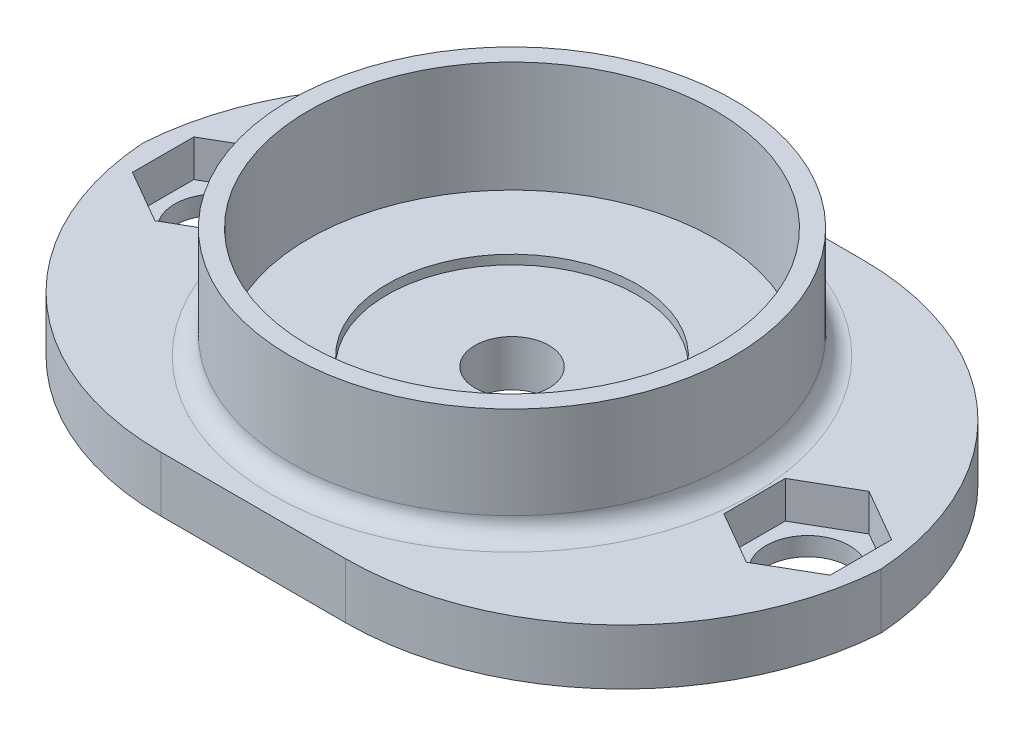
ISO-10303-21;
HEADER;
FILE_DESCRIPTION(('STEP AP214'),'2;1');
FILE_NAME('part.step','',(''),(''),'','','');
FILE_SCHEMA(('AUTOMOTIVE_DESIGN { 1 0 10303 214 1 1 1 1 }'));
ENDSEC;
DATA;
#1=APPLICATION_CONTEXT('core data for automotive mechanical design processes');
#2=APPLICATION_PROTOCOL_DEFINITION('international standard','automotive_design',2000,#1);
#3=PRODUCT_CONTEXT('',#1,'mechanical');
#4=PRODUCT('Part','Part','',(#3));
#5=PRODUCT_RELATED_PRODUCT_CATEGORY('part','',(#4));
#6=PRODUCT_DEFINITION_FORMATION('','',#4);
#7=PRODUCT_DEFINITION_CONTEXT('part definition',#1,'design');
#8=PRODUCT_DEFINITION('design','',#6,#7);
#9=PRODUCT_DEFINITION_SHAPE('','',#8);
#10=(LENGTH_UNIT() NAMED_UNIT(*) SI_UNIT(.MILLI.,.METRE.));
#11=(NAMED_UNIT(*) PLANE_ANGLE_UNIT() SI_UNIT($,.RADIAN.));
#12=(NAMED_UNIT(*) SI_UNIT($,.STERADIAN.) SOLID_ANGLE_UNIT());
#13=UNCERTAINTY_MEASURE_WITH_UNIT(LENGTH_MEASURE(1.E-05),#10,'distance_accuracy_value','');
#14=(GEOMETRIC_REPRESENTATION_CONTEXT(3) GLOBAL_UNCERTAINTY_ASSIGNED_CONTEXT((#13)) GLOBAL_UNIT_ASSIGNED_CONTEXT((#10,
#11,#12)) REPRESENTATION_CONTEXT('',''));
#15=CARTESIAN_POINT('',(0.,0.,0.));
#16=DIRECTION('',(0.,0.,1.));
#17=DIRECTION('',(1.,0.,0.));
#18=AXIS2_PLACEMENT_3D('',#15,#16,#17);
#19=CARTESIAN_POINT('',(0.,3.,0.));
#20=DIRECTION('',(0.,1.,0.));
#21=DIRECTION('',(0.,0.,1.));
#22=AXIS2_PLACEMENT_3D('',#19,#20,#21);
#23=PLANE('',#22);
#24=CARTESIAN_POINT('',(0.,3.,0.));
#25=DIRECTION('',(0.,1.,0.));
#26=DIRECTION('',(0.,0.,1.));
#27=AXIS2_PLACEMENT_3D('',#24,#25,#26);
#28=CIRCLE('',#27,13.);
#29=CARTESIAN_POINT('',(0.,3.,13.));
#30=VERTEX_POINT('',#29);
#31=EDGE_CURVE('E348',#30,#30,#28,.F.);
#32=ORIENTED_EDGE('',*,*,#31,.T.);
#33=EDGE_LOOP('',(#32));
#34=FACE_BOUND('',#33,.T.);
#35=DIRECTION('',(-0.866025403784439,0.,-0.5));
#36=VECTOR('',#35,1.);
#37=CARTESIAN_POINT('',(-13.125,3.,-1.65988202392017));
#38=LINE('',#37,#36);
#39=CARTESIAN_POINT('',(-13.125,3.,-1.65988202392017));
#40=VERTEX_POINT('',#39);
#41=CARTESIAN_POINT('',(-16.,3.,-3.31976404784035));
#42=VERTEX_POINT('',#41);
#43=EDGE_CURVE('E252',#40,#42,#38,.T.);
#44=ORIENTED_EDGE('',*,*,#43,.F.);
#45=DIRECTION('',(0.,0.,-1.));
#46=VECTOR('',#45,1.);
#47=CARTESIAN_POINT('',(-13.125,3.,1.65988202392017));
#48=LINE('',#47,#46);
#49=CARTESIAN_POINT('',(-13.125,3.,1.65988202392017));
#50=VERTEX_POINT('',#49);
#51=EDGE_CURVE('E258',#50,#40,#48,.T.);
#52=ORIENTED_EDGE('',*,*,#51,.F.);
#53=DIRECTION('',(0.866025403784439,0.,-0.5));
#54=VECTOR('',#53,1.);
#55=CARTESIAN_POINT('',(-16.,3.,3.31976404784035));
#56=LINE('',#55,#54);
#57=CARTESIAN_POINT('',(-16.,3.,3.31976404784035));
#58=VERTEX_POINT('',#57);
#59=EDGE_CURVE('E293',#58,#50,#56,.T.);
#60=ORIENTED_EDGE('',*,*,#59,.F.);
#61=DIRECTION('',(0.866025403784439,0.,0.5));
#62=VECTOR('',#61,1.);
#63=CARTESIAN_POINT('',(-18.875,3.,1.65988202392018));
#64=LINE('',#63,#62);
#65=CARTESIAN_POINT('',(-18.875,3.,1.65988202392018));
#66=VERTEX_POINT('',#65);
#67=EDGE_CURVE('E289',#66,#58,#64,.T.);
#68=ORIENTED_EDGE('',*,*,#67,.F.);
#69=DIRECTION('',(0.,0.,1.));
#70=VECTOR('',#69,1.);
#71=CARTESIAN_POINT('',(-18.875,3.,-1.65988202392017));
#72=LINE('',#71,#70);
#73=CARTESIAN_POINT('',(-18.875,3.,-1.65988202392017));
#74=VERTEX_POINT('',#73);
#75=EDGE_CURVE('E285',#74,#66,#72,.T.);
#76=ORIENTED_EDGE('',*,*,#75,.F.);
#77=DIRECTION('',(-0.866025403784439,0.,0.5));
#78=VECTOR('',#77,1.);
#79=CARTESIAN_POINT('',(-16.,3.,-3.31976404784035));
#80=LINE('',#79,#78);
#81=EDGE_CURVE('E281',#42,#74,#80,.T.);
#82=ORIENTED_EDGE('',*,*,#81,.F.);
#83=EDGE_LOOP('',(#44,#52,#60,#68,#76,#82));
#84=FACE_BOUND('',#83,.T.);
#85=DIRECTION('',(-1.,0.,0.));
#86=VECTOR('',#85,1.);
#87=CARTESIAN_POINT('',(-20.,3.,-14.));
#88=LINE('',#87,#86);
#89=CARTESIAN_POINT('',(5.,3.,-14.));
#90=VERTEX_POINT('',#89);
#91=CARTESIAN_POINT('',(-5.,3.,-14.));
#92=VERTEX_POINT('',#91);
#93=EDGE_CURVE('E330',#90,#92,#88,.T.);
#94=ORIENTED_EDGE('',*,*,#93,.T.);
#95=CARTESIAN_POINT('',(-5.,3.,0.999999999999999));
#96=DIRECTION('',(0.,1.,0.));
#97=DIRECTION('',(0.,0.,1.));
#98=AXIS2_PLACEMENT_3D('',#95,#96,#97);
#99=CIRCLE('',#98,15.);
#100=CARTESIAN_POINT('',(-19.9666295470958,3.,0.));
#101=VERTEX_POINT('',#100);
#102=EDGE_CURVE('E57',#92,#101,#99,.T.);
#103=ORIENTED_EDGE('',*,*,#102,.T.);
#104=CARTESIAN_POINT('',(-5.,3.,-0.999999999999999));
#105=DIRECTION('',(0.,1.,0.));
#106=DIRECTION('',(0.,0.,1.));
#107=AXIS2_PLACEMENT_3D('',#104,#105,#106);
#108=CIRCLE('',#107,15.);
#109=CARTESIAN_POINT('',(-5.,3.,14.));
#110=VERTEX_POINT('',#109);
#111=EDGE_CURVE('E376',#101,#110,#108,.T.);
#112=ORIENTED_EDGE('',*,*,#111,.T.);
#113=DIRECTION('',(1.,0.,0.));
#114=VECTOR('',#113,1.);
#115=CARTESIAN_POINT('',(-20.,3.,14.));
#116=LINE('',#115,#114);
#117=CARTESIAN_POINT('',(5.,3.,14.));
#118=VERTEX_POINT('',#117);
#119=EDGE_CURVE('E327',#110,#118,#116,.T.);
#120=ORIENTED_EDGE('',*,*,#119,.T.);
#121=CARTESIAN_POINT('',(5.,3.,-0.999999999999999));
#122=DIRECTION('',(0.,1.,0.));
#123=DIRECTION('',(0.,0.,1.));
#124=AXIS2_PLACEMENT_3D('',#121,#122,#123);
#125=CIRCLE('',#124,15.);
#126=CARTESIAN_POINT('',(19.9666295470958,3.,0.));
#127=VERTEX_POINT('',#126);
#128=EDGE_CURVE('E64',#118,#127,#125,.T.);
#129=ORIENTED_EDGE('',*,*,#128,.T.);
#130=CARTESIAN_POINT('',(5.,3.,0.999999999999999));
#131=DIRECTION('',(0.,1.,0.));
#132=DIRECTION('',(0.,0.,1.));
#133=AXIS2_PLACEMENT_3D('',#130,#131,#132);
#134=CIRCLE('',#133,15.);
#135=EDGE_CURVE('E371',#127,#90,#134,.T.);
#136=ORIENTED_EDGE('',*,*,#135,.T.);
#137=EDGE_LOOP('',(#94,#103,#112,#120,#129,#136));
#138=FACE_BOUND('',#137,.T.);
#139=DIRECTION('',(0.,0.,-1.));
#140=VECTOR('',#139,1.);
#141=CARTESIAN_POINT('',(13.125,3.,1.65988202392017));
#142=LINE('',#141,#140);
#143=CARTESIAN_POINT('',(13.125,3.,1.65988202392017));
#144=VERTEX_POINT('',#143);
#145=CARTESIAN_POINT('',(13.125,3.,-1.65988202392017));
#146=VERTEX_POINT('',#145);
#147=EDGE_CURVE('E216',#144,#146,#142,.T.);
#148=ORIENTED_EDGE('',*,*,#147,.T.);
#149=DIRECTION('',(0.866025403784439,0.,-0.5));
#150=VECTOR('',#149,1.);
#151=CARTESIAN_POINT('',(13.125,3.,-1.65988202392017));
#152=LINE('',#151,#150);
#153=CARTESIAN_POINT('',(16.,3.,-3.31976404784035));
#154=VERTEX_POINT('',#153);
#155=EDGE_CURVE('E187',#146,#154,#152,.T.);
#156=ORIENTED_EDGE('',*,*,#155,.T.);
#157=DIRECTION('',(0.866025403784439,0.,0.5));
#158=VECTOR('',#157,1.);
#159=CARTESIAN_POINT('',(16.,3.,-3.31976404784035));
#160=LINE('',#159,#158);
#161=CARTESIAN_POINT('',(18.875,3.,-1.65988202392017));
#162=VERTEX_POINT('',#161);
#163=EDGE_CURVE('E194',#154,#162,#160,.T.);
#164=ORIENTED_EDGE('',*,*,#163,.T.);
#165=DIRECTION('',(0.,0.,1.));
#166=VECTOR('',#165,1.);
#167=CARTESIAN_POINT('',(18.875,3.,-1.65988202392017));
#168=LINE('',#167,#166);
#169=CARTESIAN_POINT('',(18.875,3.,1.65988202392018));
#170=VERTEX_POINT('',#169);
#171=EDGE_CURVE('E198',#162,#170,#168,.T.);
#172=ORIENTED_EDGE('',*,*,#171,.T.);
#173=DIRECTION('',(-0.866025403784439,0.,0.5));
#174=VECTOR('',#173,1.);
#175=CARTESIAN_POINT('',(18.875,3.,1.65988202392018));
#176=LINE('',#175,#174);
#177=CARTESIAN_POINT('',(16.,3.,3.31976404784035));
#178=VERTEX_POINT('',#177);
#179=EDGE_CURVE('E223',#170,#178,#176,.T.);
#180=ORIENTED_EDGE('',*,*,#179,.T.);
#181=DIRECTION('',(-0.866025403784439,0.,-0.5));
#182=VECTOR('',#181,1.);
#183=CARTESIAN_POINT('',(16.,3.,3.31976404784035));
#184=LINE('',#183,#182);
#185=EDGE_CURVE('E219',#178,#144,#184,.T.);
#186=ORIENTED_EDGE('',*,*,#185,.T.);
#187=EDGE_LOOP('',(#148,#156,#164,#172,#180,#186));
#188=FACE_BOUND('',#187,.T.);
#189=ADVANCED_FACE('F39',(#34,#84,#138,#188),#23,.T.);
#190=CARTESIAN_POINT('',(-20.,3.,14.));
#191=DIRECTION('',(0.,0.,-1.));
#192=DIRECTION('',(-1.,0.,0.));
#193=AXIS2_PLACEMENT_3D('',#190,#191,#192);
#194=PLANE('',#193);
#195=DIRECTION('',(1.,0.,0.));
#196=VECTOR('',#195,1.);
#197=CARTESIAN_POINT('',(-20.,0.,14.));
#198=LINE('',#197,#196);
#199=CARTESIAN_POINT('',(-5.,0.,14.));
#200=VERTEX_POINT('',#199);
#201=CARTESIAN_POINT('',(5.,0.,14.));
#202=VERTEX_POINT('',#201);
#203=EDGE_CURVE('E326',#200,#202,#198,.T.);
#204=ORIENTED_EDGE('',*,*,#203,.T.);
#205=DIRECTION('',(0.,-1.,0.));
#206=VECTOR('',#205,1.);
#207=CARTESIAN_POINT('',(5.,3.,14.));
#208=LINE('',#207,#206);
#209=EDGE_CURVE('E11',#202,#118,#208,.F.);
#210=ORIENTED_EDGE('',*,*,#209,.T.);
#211=ORIENTED_EDGE('',*,*,#119,.F.);
#212=DIRECTION('',(0.,-1.,0.));
#213=VECTOR('',#212,1.);
#214=CARTESIAN_POINT('',(-5.,3.,14.));
#215=LINE('',#214,#213);
#216=EDGE_CURVE('E49',#110,#200,#215,.T.);
#217=ORIENTED_EDGE('',*,*,#216,.T.);
#218=EDGE_LOOP('',(#204,#210,#211,#217));
#219=FACE_BOUND('',#218,.T.);
#220=ADVANCED_FACE('F436',(#219),#194,.F.);
#221=CARTESIAN_POINT('',(-20.,3.,-14.));
#222=DIRECTION('',(0.,0.,1.));
#223=DIRECTION('',(1.,0.,0.));
#224=AXIS2_PLACEMENT_3D('',#221,#222,#223);
#225=PLANE('',#224);
#226=DIRECTION('',(-1.,0.,0.));
#227=VECTOR('',#226,1.);
#228=CARTESIAN_POINT('',(-20.,0.,-14.));
#229=LINE('',#228,#227);
#230=CARTESIAN_POINT('',(5.,0.,-14.));
#231=VERTEX_POINT('',#230);
#232=CARTESIAN_POINT('',(-5.,0.,-14.));
#233=VERTEX_POINT('',#232);
#234=EDGE_CURVE('E331',#231,#233,#229,.T.);
#235=ORIENTED_EDGE('',*,*,#234,.T.);
#236=DIRECTION('',(0.,-1.,0.));
#237=VECTOR('',#236,1.);
#238=CARTESIAN_POINT('',(-5.,3.,-14.));
#239=LINE('',#238,#237);
#240=EDGE_CURVE('E367',#233,#92,#239,.F.);
#241=ORIENTED_EDGE('',*,*,#240,.T.);
#242=ORIENTED_EDGE('',*,*,#93,.F.);
#243=DIRECTION('',(0.,-1.,0.));
#244=VECTOR('',#243,1.);
#245=CARTESIAN_POINT('',(5.,3.,-14.));
#246=LINE('',#245,#244);
#247=EDGE_CURVE('E364',#90,#231,#246,.T.);
#248=ORIENTED_EDGE('',*,*,#247,.T.);
#249=EDGE_LOOP('',(#235,#241,#242,#248));
#250=FACE_BOUND('',#249,.T.);
#251=ADVANCED_FACE('F443',(#250),#225,.F.);
#252=CARTESIAN_POINT('',(0.,0.,0.));
#253=DIRECTION('',(0.,1.,0.));
#254=DIRECTION('',(0.,0.,1.));
#255=AXIS2_PLACEMENT_3D('',#252,#253,#254);
#256=PLANE('',#255);
#257=CARTESIAN_POINT('',(0.,0.,0.));
#258=DIRECTION('',(0.,1.,0.));
#259=DIRECTION('',(0.,0.,1.));
#260=AXIS2_PLACEMENT_3D('',#257,#258,#259);
#261=CIRCLE('',#260,2.);
#262=CARTESIAN_POINT('',(0.,0.,2.));
#263=VERTEX_POINT('',#262);
#264=EDGE_CURVE('E405',#263,#263,#261,.T.);
#265=ORIENTED_EDGE('',*,*,#264,.T.);
#266=EDGE_LOOP('',(#265));
#267=FACE_BOUND('',#266,.T.);
#268=CARTESIAN_POINT('',(16.,0.,0.));
#269=DIRECTION('',(0.,1.,0.));
#270=DIRECTION('',(0.,0.,1.));
#271=AXIS2_PLACEMENT_3D('',#268,#269,#270);
#272=CIRCLE('',#271,2.25);
#273=CARTESIAN_POINT('',(16.,0.,2.25));
#274=VERTEX_POINT('',#273);
#275=EDGE_CURVE('E201',#274,#274,#272,.T.);
#276=ORIENTED_EDGE('',*,*,#275,.T.);
#277=EDGE_LOOP('',(#276));
#278=FACE_BOUND('',#277,.T.);
#279=CARTESIAN_POINT('',(-16.,0.,0.));
#280=DIRECTION('',(0.,1.,0.));
#281=DIRECTION('',(0.,0.,1.));
#282=AXIS2_PLACEMENT_3D('',#279,#280,#281);
#283=CIRCLE('',#282,2.25);
#284=CARTESIAN_POINT('',(-16.,0.,2.25));
#285=VERTEX_POINT('',#284);
#286=EDGE_CURVE('E248',#285,#285,#283,.T.);
#287=ORIENTED_EDGE('',*,*,#286,.T.);
#288=EDGE_LOOP('',(#287));
#289=FACE_BOUND('',#288,.T.);
#290=CARTESIAN_POINT('',(-5.,0.,-0.999999999999999));
#291=DIRECTION('',(0.,1.,0.));
#292=DIRECTION('',(0.,0.,1.));
#293=AXIS2_PLACEMENT_3D('',#290,#291,#292);
#294=CIRCLE('',#293,15.);
#295=CARTESIAN_POINT('',(-19.9666295470958,0.,0.));
#296=VERTEX_POINT('',#295);
#297=EDGE_CURVE('E358',#200,#296,#294,.F.);
#298=ORIENTED_EDGE('',*,*,#297,.T.);
#299=CARTESIAN_POINT('',(-5.,0.,0.999999999999999));
#300=DIRECTION('',(0.,1.,0.));
#301=DIRECTION('',(0.,0.,1.));
#302=AXIS2_PLACEMENT_3D('',#299,#300,#301);
#303=CIRCLE('',#302,15.);
#304=EDGE_CURVE('E361',#296,#233,#303,.F.);
#305=ORIENTED_EDGE('',*,*,#304,.T.);
#306=ORIENTED_EDGE('',*,*,#234,.F.);
#307=CARTESIAN_POINT('',(5.,0.,0.999999999999999));
#308=DIRECTION('',(0.,1.,0.));
#309=DIRECTION('',(0.,0.,1.));
#310=AXIS2_PLACEMENT_3D('',#307,#308,#309);
#311=CIRCLE('',#310,15.);
#312=CARTESIAN_POINT('',(19.9666295470958,0.,0.));
#313=VERTEX_POINT('',#312);
#314=EDGE_CURVE('E352',#231,#313,#311,.F.);
#315=ORIENTED_EDGE('',*,*,#314,.T.);
#316=CARTESIAN_POINT('',(5.,0.,-0.999999999999999));
#317=DIRECTION('',(0.,1.,0.));
#318=DIRECTION('',(0.,0.,1.));
#319=AXIS2_PLACEMENT_3D('',#316,#317,#318);
#320=CIRCLE('',#319,15.);
#321=EDGE_CURVE('E355',#313,#202,#320,.F.);
#322=ORIENTED_EDGE('',*,*,#321,.T.);
#323=ORIENTED_EDGE('',*,*,#203,.F.);
#324=EDGE_LOOP('',(#298,#305,#306,#315,#322,#323));
#325=FACE_BOUND('',#324,.T.);
#326=ADVANCED_FACE('F416',(#267,#278,#289,#325),#256,.F.);
#327=CARTESIAN_POINT('',(0.,9.,0.));
#328=DIRECTION('',(0.,1.,0.));
#329=DIRECTION('',(0.,0.,1.));
#330=AXIS2_PLACEMENT_3D('',#327,#328,#329);
#331=PLANE('',#330);
#332=CARTESIAN_POINT('',(0.,9.,0.));
#333=DIRECTION('',(0.,1.,0.));
#334=DIRECTION('',(0.,0.,1.));
#335=AXIS2_PLACEMENT_3D('',#332,#333,#334);
#336=CIRCLE('',#335,12.);
#337=CARTESIAN_POINT('',(0.,9.,12.));
#338=VERTEX_POINT('',#337);
#339=EDGE_CURVE('E322',#338,#338,#336,.T.);
#340=ORIENTED_EDGE('',*,*,#339,.T.);
#341=EDGE_LOOP('',(#340));
#342=FACE_BOUND('',#341,.T.);
#343=CARTESIAN_POINT('',(0.,9.,0.));
#344=DIRECTION('',(0.,1.,0.));
#345=DIRECTION('',(0.,0.,1.));
#346=AXIS2_PLACEMENT_3D('',#343,#344,#345);
#347=CIRCLE('',#346,11.);
#348=CARTESIAN_POINT('',(0.,9.,11.));
#349=VERTEX_POINT('',#348);
#350=EDGE_CURVE('E303',#349,#349,#347,.T.);
#351=ORIENTED_EDGE('',*,*,#350,.F.);
#352=EDGE_LOOP('',(#351));
#353=FACE_BOUND('',#352,.T.);
#354=ADVANCED_FACE('F471',(#342,#353),#331,.T.);
#355=CARTESIAN_POINT('',(0.,9.,0.));
#356=DIRECTION('',(0.,-1.,0.));
#357=DIRECTION('',(0.,0.,-1.));
#358=AXIS2_PLACEMENT_3D('',#355,#356,#357);
#359=CYLINDRICAL_SURFACE('',#358,12.);
#360=CARTESIAN_POINT('',(0.,4.,0.));
#361=DIRECTION('',(0.,1.,0.));
#362=DIRECTION('',(0.,0.,1.));
#363=AXIS2_PLACEMENT_3D('',#360,#361,#362);
#364=CIRCLE('',#363,12.);
#365=CARTESIAN_POINT('',(0.,4.,12.));
#366=VERTEX_POINT('',#365);
#367=EDGE_CURVE('E344',#366,#366,#364,.T.);
#368=ORIENTED_EDGE('',*,*,#367,.T.);
#369=EDGE_LOOP('',(#368));
#370=FACE_BOUND('',#369,.T.);
#371=ORIENTED_EDGE('',*,*,#339,.F.);
#372=EDGE_LOOP('',(#371));
#373=FACE_BOUND('',#372,.T.);
#374=ADVANCED_FACE('F460',(#370,#373),#359,.T.);
#375=CARTESIAN_POINT('',(0.,9.,0.));
#376=DIRECTION('',(0.,-1.,0.));
#377=DIRECTION('',(0.,0.,-1.));
#378=AXIS2_PLACEMENT_3D('',#375,#376,#377);
#379=CYLINDRICAL_SURFACE('',#378,11.);
#380=ORIENTED_EDGE('',*,*,#350,.T.);
#381=EDGE_LOOP('',(#380));
#382=FACE_BOUND('',#381,.T.);
#383=CARTESIAN_POINT('',(0.,3.,0.));
#384=DIRECTION('',(0.,1.,0.));
#385=DIRECTION('',(0.,0.,1.));
#386=AXIS2_PLACEMENT_3D('',#383,#384,#385);
#387=CIRCLE('',#386,11.);
#388=CARTESIAN_POINT('',(0.,3.,11.));
#389=VERTEX_POINT('',#388);
#390=EDGE_CURVE('E334',#389,#389,#387,.F.);
#391=ORIENTED_EDGE('',*,*,#390,.T.);
#392=EDGE_LOOP('',(#391));
#393=FACE_BOUND('',#392,.T.);
#394=ADVANCED_FACE('F451',(#382,#393),#379,.F.);
#395=CARTESIAN_POINT('',(0.,3.,0.));
#396=DIRECTION('',(0.,1.,0.));
#397=DIRECTION('',(0.,0.,1.));
#398=AXIS2_PLACEMENT_3D('',#395,#396,#397);
#399=CIRCLE('',#398,6.75);
#400=CARTESIAN_POINT('',(0.,3.,6.75));
#401=VERTEX_POINT('',#400);
#402=EDGE_CURVE('E399',#401,#401,#399,.T.);
#403=ORIENTED_EDGE('',*,*,#402,.F.);
#404=EDGE_LOOP('',(#403));
#405=FACE_BOUND('',#404,.T.);
#406=ORIENTED_EDGE('',*,*,#390,.F.);
#407=EDGE_LOOP('',(#406));
#408=FACE_BOUND('',#407,.T.);
#409=ADVANCED_FACE('F439',(#405,#408),#23,.T.);
#410=CARTESIAN_POINT('',(-13.125,1.,-1.65988202392017));
#411=DIRECTION('',(0.5,0.,-0.866025403784439));
#412=DIRECTION('',(-0.866025403784439,0.,-0.5));
#413=AXIS2_PLACEMENT_3D('',#410,#411,#412);
#414=PLANE('',#413);
#415=ORIENTED_EDGE('',*,*,#43,.T.);
#416=DIRECTION('',(0.,1.,0.));
#417=VECTOR('',#416,1.);
#418=CARTESIAN_POINT('',(-16.,1.,-3.31976404784035));
#419=LINE('',#418,#417);
#420=CARTESIAN_POINT('',(-16.,1.,-3.31976404784035));
#421=VERTEX_POINT('',#420);
#422=EDGE_CURVE('E278',#421,#42,#419,.T.);
#423=ORIENTED_EDGE('',*,*,#422,.F.);
#424=DIRECTION('',(-0.866025403784439,0.,-0.5));
#425=VECTOR('',#424,1.);
#426=CARTESIAN_POINT('',(-13.125,1.,-1.65988202392017));
#427=LINE('',#426,#425);
#428=CARTESIAN_POINT('',(-13.125,1.,-1.65988202392017));
#429=VERTEX_POINT('',#428);
#430=EDGE_CURVE('E253',#429,#421,#427,.T.);
#431=ORIENTED_EDGE('',*,*,#430,.F.);
#432=DIRECTION('',(0.,1.,0.));
#433=VECTOR('',#432,1.);
#434=CARTESIAN_POINT('',(-13.125,1.,-1.65988202392017));
#435=LINE('',#434,#433);
#436=EDGE_CURVE('E300',#429,#40,#435,.T.);
#437=ORIENTED_EDGE('',*,*,#436,.T.);
#438=EDGE_LOOP('',(#415,#423,#431,#437));
#439=FACE_BOUND('',#438,.T.);
#440=ADVANCED_FACE('F450',(#439),#414,.F.);
#441=CARTESIAN_POINT('',(-13.125,1.,1.65988202392017));
#442=DIRECTION('',(1.,0.,0.));
#443=DIRECTION('',(0.,0.,-1.));
#444=AXIS2_PLACEMENT_3D('',#441,#442,#443);
#445=PLANE('',#444);
#446=ORIENTED_EDGE('',*,*,#51,.T.);
#447=ORIENTED_EDGE('',*,*,#436,.F.);
#448=DIRECTION('',(0.,0.,-1.));
#449=VECTOR('',#448,1.);
#450=CARTESIAN_POINT('',(-13.125,1.,1.65988202392017));
#451=LINE('',#450,#449);
#452=CARTESIAN_POINT('',(-13.125,1.,1.65988202392017));
#453=VERTEX_POINT('',#452);
#454=EDGE_CURVE('E274',#453,#429,#451,.T.);
#455=ORIENTED_EDGE('',*,*,#454,.F.);
#456=DIRECTION('',(0.,1.,0.));
#457=VECTOR('',#456,1.);
#458=CARTESIAN_POINT('',(-13.125,1.,1.65988202392017));
#459=LINE('',#458,#457);
#460=EDGE_CURVE('E304',#453,#50,#459,.T.);
#461=ORIENTED_EDGE('',*,*,#460,.T.);
#462=EDGE_LOOP('',(#446,#447,#455,#461));
#463=FACE_BOUND('',#462,.T.);
#464=ADVANCED_FACE('F457',(#463),#445,.F.);
#465=CARTESIAN_POINT('',(-16.,1.,3.31976404784035));
#466=DIRECTION('',(0.5,0.,0.866025403784439));
#467=DIRECTION('',(0.866025403784439,0.,-0.5));
#468=AXIS2_PLACEMENT_3D('',#465,#466,#467);
#469=PLANE('',#468);
#470=ORIENTED_EDGE('',*,*,#59,.T.);
#471=ORIENTED_EDGE('',*,*,#460,.F.);
#472=DIRECTION('',(0.866025403784439,0.,-0.5));
#473=VECTOR('',#472,1.);
#474=CARTESIAN_POINT('',(-16.,1.,3.31976404784035));
#475=LINE('',#474,#473);
#476=CARTESIAN_POINT('',(-16.,1.,3.31976404784035));
#477=VERTEX_POINT('',#476);
#478=EDGE_CURVE('E270',#477,#453,#475,.T.);
#479=ORIENTED_EDGE('',*,*,#478,.F.);
#480=DIRECTION('',(0.,1.,0.));
#481=VECTOR('',#480,1.);
#482=CARTESIAN_POINT('',(-16.,1.,3.31976404784035));
#483=LINE('',#482,#481);
#484=EDGE_CURVE('E307',#477,#58,#483,.T.);
#485=ORIENTED_EDGE('',*,*,#484,.T.);
#486=EDGE_LOOP('',(#470,#471,#479,#485));
#487=FACE_BOUND('',#486,.T.);
#488=ADVANCED_FACE('F561',(#487),#469,.F.);
#489=CARTESIAN_POINT('',(-18.875,1.,1.65988202392018));
#490=DIRECTION('',(-0.5,0.,0.866025403784439));
#491=DIRECTION('',(0.866025403784439,0.,0.5));
#492=AXIS2_PLACEMENT_3D('',#489,#490,#491);
#493=PLANE('',#492);
#494=ORIENTED_EDGE('',*,*,#67,.T.);
#495=ORIENTED_EDGE('',*,*,#484,.F.);
#496=DIRECTION('',(0.866025403784439,0.,0.5));
#497=VECTOR('',#496,1.);
#498=CARTESIAN_POINT('',(-18.875,1.,1.65988202392018));
#499=LINE('',#498,#497);
#500=CARTESIAN_POINT('',(-18.875,1.,1.65988202392018));
#501=VERTEX_POINT('',#500);
#502=EDGE_CURVE('E266',#501,#477,#499,.T.);
#503=ORIENTED_EDGE('',*,*,#502,.F.);
#504=DIRECTION('',(0.,1.,0.));
#505=VECTOR('',#504,1.);
#506=CARTESIAN_POINT('',(-18.875,1.,1.65988202392018));
#507=LINE('',#506,#505);
#508=EDGE_CURVE('E310',#501,#66,#507,.T.);
#509=ORIENTED_EDGE('',*,*,#508,.T.);
#510=EDGE_LOOP('',(#494,#495,#503,#509));
#511=FACE_BOUND('',#510,.T.);
#512=ADVANCED_FACE('F565',(#511),#493,.F.);
#513=CARTESIAN_POINT('',(-18.875,1.,-1.65988202392017));
#514=DIRECTION('',(-1.,0.,0.));
#515=DIRECTION('',(0.,0.,1.));
#516=AXIS2_PLACEMENT_3D('',#513,#514,#515);
#517=PLANE('',#516);
#518=ORIENTED_EDGE('',*,*,#75,.T.);
#519=ORIENTED_EDGE('',*,*,#508,.F.);
#520=DIRECTION('',(0.,0.,1.));
#521=VECTOR('',#520,1.);
#522=CARTESIAN_POINT('',(-18.875,1.,-1.65988202392017));
#523=LINE('',#522,#521);
#524=CARTESIAN_POINT('',(-18.875,1.,-1.65988202392017));
#525=VERTEX_POINT('',#524);
#526=EDGE_CURVE('E262',#525,#501,#523,.T.);
#527=ORIENTED_EDGE('',*,*,#526,.F.);
#528=DIRECTION('',(0.,1.,0.));
#529=VECTOR('',#528,1.);
#530=CARTESIAN_POINT('',(-18.875,1.,-1.65988202392017));
#531=LINE('',#530,#529);
#532=EDGE_CURVE('E313',#525,#74,#531,.T.);
#533=ORIENTED_EDGE('',*,*,#532,.T.);
#534=EDGE_LOOP('',(#518,#519,#527,#533));
#535=FACE_BOUND('',#534,.T.);
#536=ADVANCED_FACE('F569',(#535),#517,.F.);
#537=CARTESIAN_POINT('',(-16.,1.,-3.31976404784035));
#538=DIRECTION('',(-0.5,0.,-0.866025403784439));
#539=DIRECTION('',(-0.866025403784439,0.,0.5));
#540=AXIS2_PLACEMENT_3D('',#537,#538,#539);
#541=PLANE('',#540);
#542=ORIENTED_EDGE('',*,*,#81,.T.);
#543=ORIENTED_EDGE('',*,*,#532,.F.);
#544=DIRECTION('',(-0.866025403784439,0.,0.5));
#545=VECTOR('',#544,1.);
#546=CARTESIAN_POINT('',(-16.,1.,-3.31976404784035));
#547=LINE('',#546,#545);
#548=EDGE_CURVE('E257',#421,#525,#547,.T.);
#549=ORIENTED_EDGE('',*,*,#548,.F.);
#550=ORIENTED_EDGE('',*,*,#422,.T.);
#551=EDGE_LOOP('',(#542,#543,#549,#550));
#552=FACE_BOUND('',#551,.T.);
#553=ADVANCED_FACE('F557',(#552),#541,.F.);
#554=CARTESIAN_POINT('',(0.,1.,0.));
#555=DIRECTION('',(0.,1.,0.));
#556=DIRECTION('',(0.,0.,1.));
#557=AXIS2_PLACEMENT_3D('',#554,#555,#556);
#558=PLANE('',#557);
#559=CARTESIAN_POINT('',(-16.,1.,0.));
#560=DIRECTION('',(0.,1.,0.));
#561=DIRECTION('',(0.,0.,1.));
#562=AXIS2_PLACEMENT_3D('',#559,#560,#561);
#563=CIRCLE('',#562,2.25);
#564=CARTESIAN_POINT('',(-16.,1.,2.25));
#565=VERTEX_POINT('',#564);
#566=EDGE_CURVE('E233',#565,#565,#563,.T.);
#567=ORIENTED_EDGE('',*,*,#566,.F.);
#568=EDGE_LOOP('',(#567));
#569=FACE_BOUND('',#568,.T.);
#570=ORIENTED_EDGE('',*,*,#430,.T.);
#571=ORIENTED_EDGE('',*,*,#548,.T.);
#572=ORIENTED_EDGE('',*,*,#526,.T.);
#573=ORIENTED_EDGE('',*,*,#502,.T.);
#574=ORIENTED_EDGE('',*,*,#478,.T.);
#575=ORIENTED_EDGE('',*,*,#454,.T.);
#576=EDGE_LOOP('',(#570,#571,#572,#573,#574,#575));
#577=FACE_BOUND('',#576,.T.);
#578=ADVANCED_FACE('F553',(#569,#577),#558,.T.);
#579=CARTESIAN_POINT('',(-16.,1.,0.));
#580=DIRECTION('',(0.,1.,0.));
#581=DIRECTION('',(0.,0.,1.));
#582=AXIS2_PLACEMENT_3D('',#579,#580,#581);
#583=CYLINDRICAL_SURFACE('',#582,2.25);
#584=ORIENTED_EDGE('',*,*,#566,.T.);
#585=EDGE_LOOP('',(#584));
#586=FACE_BOUND('',#585,.T.);
#587=ORIENTED_EDGE('',*,*,#286,.F.);
#588=EDGE_LOOP('',(#587));
#589=FACE_BOUND('',#588,.T.);
#590=ADVANCED_FACE('F540',(#586,#589),#583,.F.);
#591=CARTESIAN_POINT('',(13.125,1.,-1.65988202392017));
#592=DIRECTION('',(0.5,0.,0.866025403784439));
#593=DIRECTION('',(0.866025403784439,0.,-0.5));
#594=AXIS2_PLACEMENT_3D('',#591,#592,#593);
#595=PLANE('',#594);
#596=ORIENTED_EDGE('',*,*,#155,.F.);
#597=DIRECTION('',(0.,1.,0.));
#598=VECTOR('',#597,1.);
#599=CARTESIAN_POINT('',(13.125,1.,-1.65988202392017));
#600=LINE('',#599,#598);
#601=CARTESIAN_POINT('',(13.125,1.,-1.65988202392017));
#602=VERTEX_POINT('',#601);
#603=EDGE_CURVE('E171',#602,#146,#600,.T.);
#604=ORIENTED_EDGE('',*,*,#603,.F.);
#605=DIRECTION('',(0.866025403784439,0.,-0.5));
#606=VECTOR('',#605,1.);
#607=CARTESIAN_POINT('',(13.125,1.,-1.65988202392017));
#608=LINE('',#607,#606);
#609=CARTESIAN_POINT('',(16.,1.,-3.31976404784035));
#610=VERTEX_POINT('',#609);
#611=EDGE_CURVE('E179',#602,#610,#608,.T.);
#612=ORIENTED_EDGE('',*,*,#611,.T.);
#613=DIRECTION('',(0.,1.,0.));
#614=VECTOR('',#613,1.);
#615=CARTESIAN_POINT('',(16.,1.,-3.31976404784035));
#616=LINE('',#615,#614);
#617=EDGE_CURVE('E230',#610,#154,#616,.T.);
#618=ORIENTED_EDGE('',*,*,#617,.T.);
#619=EDGE_LOOP('',(#596,#604,#612,#618));
#620=FACE_BOUND('',#619,.T.);
#621=ADVANCED_FACE('F183',(#620),#595,.T.);
#622=CARTESIAN_POINT('',(16.,1.,-3.31976404784035));
#623=DIRECTION('',(-0.5,0.,0.866025403784439));
#624=DIRECTION('',(0.866025403784439,0.,0.5));
#625=AXIS2_PLACEMENT_3D('',#622,#623,#624);
#626=PLANE('',#625);
#627=ORIENTED_EDGE('',*,*,#163,.F.);
#628=ORIENTED_EDGE('',*,*,#617,.F.);
#629=DIRECTION('',(0.866025403784439,0.,0.5));
#630=VECTOR('',#629,1.);
#631=CARTESIAN_POINT('',(16.,1.,-3.31976404784035));
#632=LINE('',#631,#630);
#633=CARTESIAN_POINT('',(18.875,1.,-1.65988202392017));
#634=VERTEX_POINT('',#633);
#635=EDGE_CURVE('E189',#610,#634,#632,.T.);
#636=ORIENTED_EDGE('',*,*,#635,.T.);
#637=DIRECTION('',(0.,1.,0.));
#638=VECTOR('',#637,1.);
#639=CARTESIAN_POINT('',(18.875,1.,-1.65988202392017));
#640=LINE('',#639,#638);
#641=EDGE_CURVE('E234',#634,#162,#640,.T.);
#642=ORIENTED_EDGE('',*,*,#641,.T.);
#643=EDGE_LOOP('',(#627,#628,#636,#642));
#644=FACE_BOUND('',#643,.T.);
#645=ADVANCED_FACE('F532',(#644),#626,.T.);
#646=CARTESIAN_POINT('',(18.875,1.,-1.65988202392017));
#647=DIRECTION('',(-1.,0.,0.));
#648=DIRECTION('',(0.,0.,1.));
#649=AXIS2_PLACEMENT_3D('',#646,#647,#648);
#650=PLANE('',#649);
#651=ORIENTED_EDGE('',*,*,#171,.F.);
#652=ORIENTED_EDGE('',*,*,#641,.F.);
#653=DIRECTION('',(0.,0.,1.));
#654=VECTOR('',#653,1.);
#655=CARTESIAN_POINT('',(18.875,1.,-1.65988202392017));
#656=LINE('',#655,#654);
#657=CARTESIAN_POINT('',(18.875,1.,1.65988202392018));
#658=VERTEX_POINT('',#657);
#659=EDGE_CURVE('E209',#634,#658,#656,.T.);
#660=ORIENTED_EDGE('',*,*,#659,.T.);
#661=DIRECTION('',(0.,1.,0.));
#662=VECTOR('',#661,1.);
#663=CARTESIAN_POINT('',(18.875,1.,1.65988202392018));
#664=LINE('',#663,#662);
#665=EDGE_CURVE('E237',#658,#170,#664,.T.);
#666=ORIENTED_EDGE('',*,*,#665,.T.);
#667=EDGE_LOOP('',(#651,#652,#660,#666));
#668=FACE_BOUND('',#667,.T.);
#669=ADVANCED_FACE('F529',(#668),#650,.T.);
#670=CARTESIAN_POINT('',(18.875,1.,1.65988202392018));
#671=DIRECTION('',(-0.5,0.,-0.866025403784439));
#672=DIRECTION('',(-0.866025403784439,0.,0.5));
#673=AXIS2_PLACEMENT_3D('',#670,#671,#672);
#674=PLANE('',#673);
#675=ORIENTED_EDGE('',*,*,#179,.F.);
#676=ORIENTED_EDGE('',*,*,#665,.F.);
#677=DIRECTION('',(-0.866025403784439,0.,0.5));
#678=VECTOR('',#677,1.);
#679=CARTESIAN_POINT('',(18.875,1.,1.65988202392018));
#680=LINE('',#679,#678);
#681=CARTESIAN_POINT('',(16.,1.,3.31976404784035));
#682=VERTEX_POINT('',#681);
#683=EDGE_CURVE('E206',#658,#682,#680,.T.);
#684=ORIENTED_EDGE('',*,*,#683,.T.);
#685=DIRECTION('',(0.,1.,0.));
#686=VECTOR('',#685,1.);
#687=CARTESIAN_POINT('',(16.,1.,3.31976404784035));
#688=LINE('',#687,#686);
#689=EDGE_CURVE('E240',#682,#178,#688,.T.);
#690=ORIENTED_EDGE('',*,*,#689,.T.);
#691=EDGE_LOOP('',(#675,#676,#684,#690));
#692=FACE_BOUND('',#691,.T.);
#693=ADVANCED_FACE('F526',(#692),#674,.T.);
#694=CARTESIAN_POINT('',(16.,1.,3.31976404784035));
#695=DIRECTION('',(0.5,0.,-0.866025403784439));
#696=DIRECTION('',(-0.866025403784439,0.,-0.5));
#697=AXIS2_PLACEMENT_3D('',#694,#695,#696);
#698=PLANE('',#697);
#699=ORIENTED_EDGE('',*,*,#185,.F.);
#700=ORIENTED_EDGE('',*,*,#689,.F.);
#701=DIRECTION('',(-0.866025403784439,0.,-0.5));
#702=VECTOR('',#701,1.);
#703=CARTESIAN_POINT('',(16.,1.,3.31976404784035));
#704=LINE('',#703,#702);
#705=CARTESIAN_POINT('',(13.125,1.,1.65988202392017));
#706=VERTEX_POINT('',#705);
#707=EDGE_CURVE('E178',#682,#706,#704,.T.);
#708=ORIENTED_EDGE('',*,*,#707,.T.);
#709=DIRECTION('',(0.,1.,0.));
#710=VECTOR('',#709,1.);
#711=CARTESIAN_POINT('',(13.125,1.,1.65988202392017));
#712=LINE('',#711,#710);
#713=EDGE_CURVE('E173',#706,#144,#712,.T.);
#714=ORIENTED_EDGE('',*,*,#713,.T.);
#715=EDGE_LOOP('',(#699,#700,#708,#714));
#716=FACE_BOUND('',#715,.T.);
#717=ADVANCED_FACE('F522',(#716),#698,.T.);
#718=CARTESIAN_POINT('',(13.125,1.,1.65988202392017));
#719=DIRECTION('',(1.,0.,0.));
#720=DIRECTION('',(0.,0.,-1.));
#721=AXIS2_PLACEMENT_3D('',#718,#719,#720);
#722=PLANE('',#721);
#723=ORIENTED_EDGE('',*,*,#147,.F.);
#724=ORIENTED_EDGE('',*,*,#713,.F.);
#725=DIRECTION('',(0.,0.,-1.));
#726=VECTOR('',#725,1.);
#727=CARTESIAN_POINT('',(13.125,1.,1.65988202392017));
#728=LINE('',#727,#726);
#729=EDGE_CURVE('E167',#706,#602,#728,.T.);
#730=ORIENTED_EDGE('',*,*,#729,.T.);
#731=ORIENTED_EDGE('',*,*,#603,.T.);
#732=EDGE_LOOP('',(#723,#724,#730,#731));
#733=FACE_BOUND('',#732,.T.);
#734=ADVANCED_FACE('F170',(#733),#722,.T.);
#735=CARTESIAN_POINT('',(0.,1.,0.));
#736=DIRECTION('',(0.,1.,0.));
#737=DIRECTION('',(0.,0.,1.));
#738=AXIS2_PLACEMENT_3D('',#735,#736,#737);
#739=PLANE('',#738);
#740=CARTESIAN_POINT('',(16.,1.,0.));
#741=DIRECTION('',(0.,1.,0.));
#742=DIRECTION('',(0.,0.,1.));
#743=AXIS2_PLACEMENT_3D('',#740,#741,#742);
#744=CIRCLE('',#743,2.25);
#745=CARTESIAN_POINT('',(16.,1.,2.25));
#746=VERTEX_POINT('',#745);
#747=EDGE_CURVE('E385',#746,#746,#744,.T.);
#748=ORIENTED_EDGE('',*,*,#747,.F.);
#749=EDGE_LOOP('',(#748));
#750=FACE_BOUND('',#749,.T.);
#751=ORIENTED_EDGE('',*,*,#611,.F.);
#752=ORIENTED_EDGE('',*,*,#729,.F.);
#753=ORIENTED_EDGE('',*,*,#707,.F.);
#754=ORIENTED_EDGE('',*,*,#683,.F.);
#755=ORIENTED_EDGE('',*,*,#659,.F.);
#756=ORIENTED_EDGE('',*,*,#635,.F.);
#757=EDGE_LOOP('',(#751,#752,#753,#754,#755,#756));
#758=FACE_BOUND('',#757,.T.);
#759=ADVANCED_FACE('F191',(#750,#758),#739,.T.);
#760=CARTESIAN_POINT('',(16.,1.,0.));
#761=DIRECTION('',(0.,1.,0.));
#762=DIRECTION('',(0.,0.,1.));
#763=AXIS2_PLACEMENT_3D('',#760,#761,#762);
#764=CYLINDRICAL_SURFACE('',#763,2.25);
#765=ORIENTED_EDGE('',*,*,#747,.T.);
#766=EDGE_LOOP('',(#765));
#767=FACE_BOUND('',#766,.T.);
#768=ORIENTED_EDGE('',*,*,#275,.F.);
#769=EDGE_LOOP('',(#768));
#770=FACE_BOUND('',#769,.T.);
#771=ADVANCED_FACE('F494',(#767,#770),#764,.F.);
#772=CARTESIAN_POINT('',(0.,4.,0.));
#773=DIRECTION('',(0.,1.,0.));
#774=DIRECTION('',(0.,0.,1.));
#775=AXIS2_PLACEMENT_3D('',#772,#773,#774);
#776=TOROIDAL_SURFACE('',#775,13.,1.);
#777=ORIENTED_EDGE('',*,*,#31,.F.);
#778=EDGE_LOOP('',(#777));
#779=FACE_BOUND('',#778,.T.);
#780=ORIENTED_EDGE('',*,*,#367,.F.);
#781=EDGE_LOOP('',(#780));
#782=FACE_BOUND('',#781,.T.);
#783=ADVANCED_FACE('F490',(#779,#782),#776,.F.);
#784=CARTESIAN_POINT('',(-5.,3.,-0.999999999999999));
#785=DIRECTION('',(0.,-1.,0.));
#786=DIRECTION('',(0.,0.,-1.));
#787=AXIS2_PLACEMENT_3D('',#784,#785,#786);
#788=CYLINDRICAL_SURFACE('',#787,15.);
#789=ORIENTED_EDGE('',*,*,#216,.F.);
#790=ORIENTED_EDGE('',*,*,#111,.F.);
#791=DIRECTION('',(0.,-1.,0.));
#792=VECTOR('',#791,1.);
#793=CARTESIAN_POINT('',(-19.9666295470958,1.5,0.));
#794=LINE('',#793,#792);
#795=EDGE_CURVE('E382',#296,#101,#794,.F.);
#796=ORIENTED_EDGE('',*,*,#795,.F.);
#797=ORIENTED_EDGE('',*,*,#297,.F.);
#798=EDGE_LOOP('',(#789,#790,#796,#797));
#799=FACE_BOUND('',#798,.T.);
#800=ADVANCED_FACE('F493',(#799),#788,.T.);
#801=CARTESIAN_POINT('',(-5.,3.,0.999999999999999));
#802=DIRECTION('',(0.,-1.,0.));
#803=DIRECTION('',(0.,0.,-1.));
#804=AXIS2_PLACEMENT_3D('',#801,#802,#803);
#805=CYLINDRICAL_SURFACE('',#804,15.);
#806=ORIENTED_EDGE('',*,*,#102,.F.);
#807=ORIENTED_EDGE('',*,*,#240,.F.);
#808=ORIENTED_EDGE('',*,*,#304,.F.);
#809=ORIENTED_EDGE('',*,*,#795,.T.);
#810=EDGE_LOOP('',(#806,#807,#808,#809));
#811=FACE_BOUND('',#810,.T.);
#812=ADVANCED_FACE('F496',(#811),#805,.T.);
#813=CARTESIAN_POINT('',(5.,3.,0.999999999999999));
#814=DIRECTION('',(0.,-1.,0.));
#815=DIRECTION('',(0.,0.,-1.));
#816=AXIS2_PLACEMENT_3D('',#813,#814,#815);
#817=CYLINDRICAL_SURFACE('',#816,15.);
#818=ORIENTED_EDGE('',*,*,#247,.F.);
#819=ORIENTED_EDGE('',*,*,#135,.F.);
#820=DIRECTION('',(0.,-1.,0.));
#821=VECTOR('',#820,1.);
#822=CARTESIAN_POINT('',(19.9666295470958,1.5,0.));
#823=LINE('',#822,#821);
#824=EDGE_CURVE('E43',#313,#127,#823,.F.);
#825=ORIENTED_EDGE('',*,*,#824,.F.);
#826=ORIENTED_EDGE('',*,*,#314,.F.);
#827=EDGE_LOOP('',(#818,#819,#825,#826));
#828=FACE_BOUND('',#827,.T.);
#829=ADVANCED_FACE('F41',(#828),#817,.T.);
#830=CARTESIAN_POINT('',(5.,3.,-0.999999999999999));
#831=DIRECTION('',(0.,-1.,0.));
#832=DIRECTION('',(0.,0.,-1.));
#833=AXIS2_PLACEMENT_3D('',#830,#831,#832);
#834=CYLINDRICAL_SURFACE('',#833,15.);
#835=ORIENTED_EDGE('',*,*,#128,.F.);
#836=ORIENTED_EDGE('',*,*,#209,.F.);
#837=ORIENTED_EDGE('',*,*,#321,.F.);
#838=ORIENTED_EDGE('',*,*,#824,.T.);
#839=EDGE_LOOP('',(#835,#836,#837,#838));
#840=FACE_BOUND('',#839,.T.);
#841=ADVANCED_FACE('F432',(#840),#834,.T.);
#842=CARTESIAN_POINT('',(0.,2.5,0.));
#843=DIRECTION('',(0.,1.,0.));
#844=DIRECTION('',(0.,0.,1.));
#845=AXIS2_PLACEMENT_3D('',#842,#843,#844);
#846=CYLINDRICAL_SURFACE('',#845,6.75);
#847=CARTESIAN_POINT('',(0.,2.5,0.));
#848=DIRECTION('',(0.,1.,0.));
#849=DIRECTION('',(0.,0.,1.));
#850=AXIS2_PLACEMENT_3D('',#847,#848,#849);
#851=CIRCLE('',#850,6.75);
#852=CARTESIAN_POINT('',(0.,2.5,6.75));
#853=VERTEX_POINT('',#852);
#854=EDGE_CURVE('E393',#853,#853,#851,.T.);
#855=ORIENTED_EDGE('',*,*,#854,.F.);
#856=EDGE_LOOP('',(#855));
#857=FACE_BOUND('',#856,.T.);
#858=ORIENTED_EDGE('',*,*,#402,.T.);
#859=EDGE_LOOP('',(#858));
#860=FACE_BOUND('',#859,.T.);
#861=ADVANCED_FACE('F427',(#857,#860),#846,.F.);
#862=CARTESIAN_POINT('',(0.,2.5,0.));
#863=DIRECTION('',(0.,1.,0.));
#864=DIRECTION('',(0.,0.,1.));
#865=AXIS2_PLACEMENT_3D('',#862,#863,#864);
#866=PLANE('',#865);
#867=CARTESIAN_POINT('',(0.,2.5,0.));
#868=DIRECTION('',(0.,1.,0.));
#869=DIRECTION('',(0.,0.,1.));
#870=AXIS2_PLACEMENT_3D('',#867,#868,#869);
#871=CIRCLE('',#870,2.);
#872=CARTESIAN_POINT('',(0.,2.5,2.));
#873=VERTEX_POINT('',#872);
#874=EDGE_CURVE('E408',#873,#873,#871,.T.);
#875=ORIENTED_EDGE('',*,*,#874,.F.);
#876=EDGE_LOOP('',(#875));
#877=FACE_BOUND('',#876,.T.);
#878=ORIENTED_EDGE('',*,*,#854,.T.);
#879=EDGE_LOOP('',(#878));
#880=FACE_BOUND('',#879,.T.);
#881=ADVANCED_FACE('F422',(#877,#880),#866,.T.);
#882=CARTESIAN_POINT('',(0.,0.,0.));
#883=DIRECTION('',(0.,1.,0.));
#884=DIRECTION('',(0.,0.,1.));
#885=AXIS2_PLACEMENT_3D('',#882,#883,#884);
#886=CYLINDRICAL_SURFACE('',#885,2.);
#887=ORIENTED_EDGE('',*,*,#264,.F.);
#888=EDGE_LOOP('',(#887));
#889=FACE_BOUND('',#888,.T.);
#890=ORIENTED_EDGE('',*,*,#874,.T.);
#891=EDGE_LOOP('',(#890));
#892=FACE_BOUND('',#891,.T.);
#893=ADVANCED_FACE('F419',(#889,#892),#886,.F.);
#894=CLOSED_SHELL('',(#189,#220,#251,#326,#354,#374,#394,#409,#440,#464,#488,#512,#536,#553,
#578,#590,#621,#645,#669,#693,#717,#734,#759,#771,#783,#800,#812,#829,#841,#861,#881,#893));
#895=MANIFOLD_SOLID_BREP('B2',#894);
#896=ADVANCED_BREP_SHAPE_REPRESENTATION('',(#18,#895),#14);
#897=SHAPE_DEFINITION_REPRESENTATION(#9,#896);
ENDSEC;
END-ISO-10303-21;
